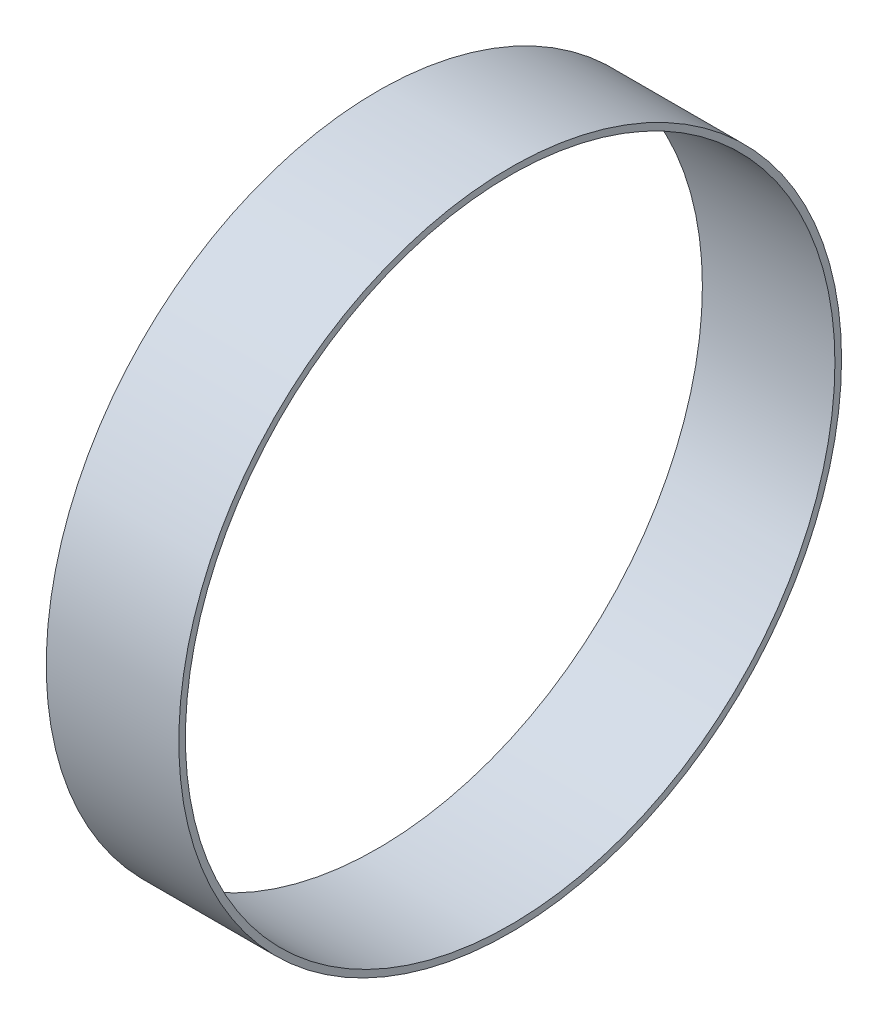
ISO-10303-21;
HEADER;
FILE_DESCRIPTION(('STEP AP214'),'2;1');
FILE_NAME('part.step','',(''),(''),'','','');
FILE_SCHEMA(('AUTOMOTIVE_DESIGN { 1 0 10303 214 1 1 1 1 }'));
ENDSEC;
DATA;
#1=APPLICATION_CONTEXT('core data for automotive mechanical design processes');
#2=APPLICATION_PROTOCOL_DEFINITION('international standard','automotive_design',2000,#1);
#3=PRODUCT_CONTEXT('',#1,'mechanical');
#4=PRODUCT('Part','Part','',(#3));
#5=PRODUCT_RELATED_PRODUCT_CATEGORY('part','',(#4));
#6=PRODUCT_DEFINITION_FORMATION('','',#4);
#7=PRODUCT_DEFINITION_CONTEXT('part definition',#1,'design');
#8=PRODUCT_DEFINITION('design','',#6,#7);
#9=PRODUCT_DEFINITION_SHAPE('','',#8);
#10=(LENGTH_UNIT() NAMED_UNIT(*) SI_UNIT(.MILLI.,.METRE.));
#11=(NAMED_UNIT(*) PLANE_ANGLE_UNIT() SI_UNIT($,.RADIAN.));
#12=(NAMED_UNIT(*) SI_UNIT($,.STERADIAN.) SOLID_ANGLE_UNIT());
#13=UNCERTAINTY_MEASURE_WITH_UNIT(LENGTH_MEASURE(1.E-05),#10,'distance_accuracy_value','');
#14=(GEOMETRIC_REPRESENTATION_CONTEXT(3) GLOBAL_UNCERTAINTY_ASSIGNED_CONTEXT((#13)) GLOBAL_UNIT_ASSIGNED_CONTEXT((#10,
#11,#12)) REPRESENTATION_CONTEXT('',''));
#15=CARTESIAN_POINT('',(0.,0.,0.));
#16=DIRECTION('',(0.,0.,1.));
#17=DIRECTION('',(1.,0.,0.));
#18=AXIS2_PLACEMENT_3D('',#15,#16,#17);
#19=CARTESIAN_POINT('',(10.,0.,0.));
#20=DIRECTION('',(1.,0.,0.));
#21=DIRECTION('',(0.,0.,-1.));
#22=AXIS2_PLACEMENT_3D('',#19,#20,#21);
#23=PLANE('',#22);
#24=CARTESIAN_POINT('',(10.,0.,0.));
#25=DIRECTION('',(1.,0.,0.));
#26=DIRECTION('',(0.,0.,-1.));
#27=AXIS2_PLACEMENT_3D('',#24,#25,#26);
#28=CIRCLE('',#27,25.);
#29=CARTESIAN_POINT('',(10.,0.,-25.));
#30=VERTEX_POINT('',#29);
#31=EDGE_CURVE('E10',#30,#30,#28,.T.);
#32=ORIENTED_EDGE('',*,*,#31,.T.);
#33=EDGE_LOOP('',(#32));
#34=FACE_BOUND('',#33,.T.);
#35=CARTESIAN_POINT('',(10.,0.,0.));
#36=DIRECTION('',(1.,0.,0.));
#37=DIRECTION('',(0.,0.,-1.));
#38=AXIS2_PLACEMENT_3D('',#35,#36,#37);
#39=CIRCLE('',#38,24.5);
#40=CARTESIAN_POINT('',(10.,0.,-24.5));
#41=VERTEX_POINT('',#40);
#42=EDGE_CURVE('E56',#41,#41,#39,.T.);
#43=ORIENTED_EDGE('',*,*,#42,.F.);
#44=EDGE_LOOP('',(#43));
#45=FACE_BOUND('',#44,.T.);
#46=ADVANCED_FACE('F43',(#34,#45),#23,.T.);
#47=CARTESIAN_POINT('',(0.,0.,0.));
#48=DIRECTION('',(1.,0.,0.));
#49=DIRECTION('',(0.,0.,-1.));
#50=AXIS2_PLACEMENT_3D('',#47,#48,#49);
#51=PLANE('',#50);
#52=CARTESIAN_POINT('',(0.,0.,0.));
#53=DIRECTION('',(1.,0.,0.));
#54=DIRECTION('',(0.,0.,-1.));
#55=AXIS2_PLACEMENT_3D('',#52,#53,#54);
#56=CIRCLE('',#55,25.);
#57=CARTESIAN_POINT('',(0.,0.,-25.));
#58=VERTEX_POINT('',#57);
#59=EDGE_CURVE('E47',#58,#58,#56,.T.);
#60=ORIENTED_EDGE('',*,*,#59,.F.);
#61=EDGE_LOOP('',(#60));
#62=FACE_BOUND('',#61,.T.);
#63=CARTESIAN_POINT('',(0.,0.,0.));
#64=DIRECTION('',(1.,0.,0.));
#65=DIRECTION('',(0.,0.,-1.));
#66=AXIS2_PLACEMENT_3D('',#63,#64,#65);
#67=CIRCLE('',#66,24.5);
#68=CARTESIAN_POINT('',(0.,0.,-24.5));
#69=VERTEX_POINT('',#68);
#70=EDGE_CURVE('E58',#69,#69,#67,.T.);
#71=ORIENTED_EDGE('',*,*,#70,.T.);
#72=EDGE_LOOP('',(#71));
#73=FACE_BOUND('',#72,.T.);
#74=ADVANCED_FACE('F70',(#62,#73),#51,.F.);
#75=CARTESIAN_POINT('',(10.,0.,0.));
#76=DIRECTION('',(-1.,0.,0.));
#77=DIRECTION('',(0.,0.,1.));
#78=AXIS2_PLACEMENT_3D('',#75,#76,#77);
#79=CYLINDRICAL_SURFACE('',#78,25.);
#80=ORIENTED_EDGE('',*,*,#31,.F.);
#81=EDGE_LOOP('',(#80));
#82=FACE_BOUND('',#81,.T.);
#83=ORIENTED_EDGE('',*,*,#59,.T.);
#84=EDGE_LOOP('',(#83));
#85=FACE_BOUND('',#84,.T.);
#86=ADVANCED_FACE('F45',(#82,#85),#79,.T.);
#87=CARTESIAN_POINT('',(10.,0.,0.));
#88=DIRECTION('',(-1.,0.,0.));
#89=DIRECTION('',(0.,0.,1.));
#90=AXIS2_PLACEMENT_3D('',#87,#88,#89);
#91=CYLINDRICAL_SURFACE('',#90,24.5);
#92=ORIENTED_EDGE('',*,*,#42,.T.);
#93=EDGE_LOOP('',(#92));
#94=FACE_BOUND('',#93,.T.);
#95=ORIENTED_EDGE('',*,*,#70,.F.);
#96=EDGE_LOOP('',(#95));
#97=FACE_BOUND('',#96,.T.);
#98=ADVANCED_FACE('F66',(#94,#97),#91,.F.);
#99=CLOSED_SHELL('',(#46,#74,#86,#98));
#100=MANIFOLD_SOLID_BREP('B2',#99);
#101=ADVANCED_BREP_SHAPE_REPRESENTATION('',(#18,#100),#14);
#102=SHAPE_DEFINITION_REPRESENTATION(#9,#101);
ENDSEC;
END-ISO-10303-21;
